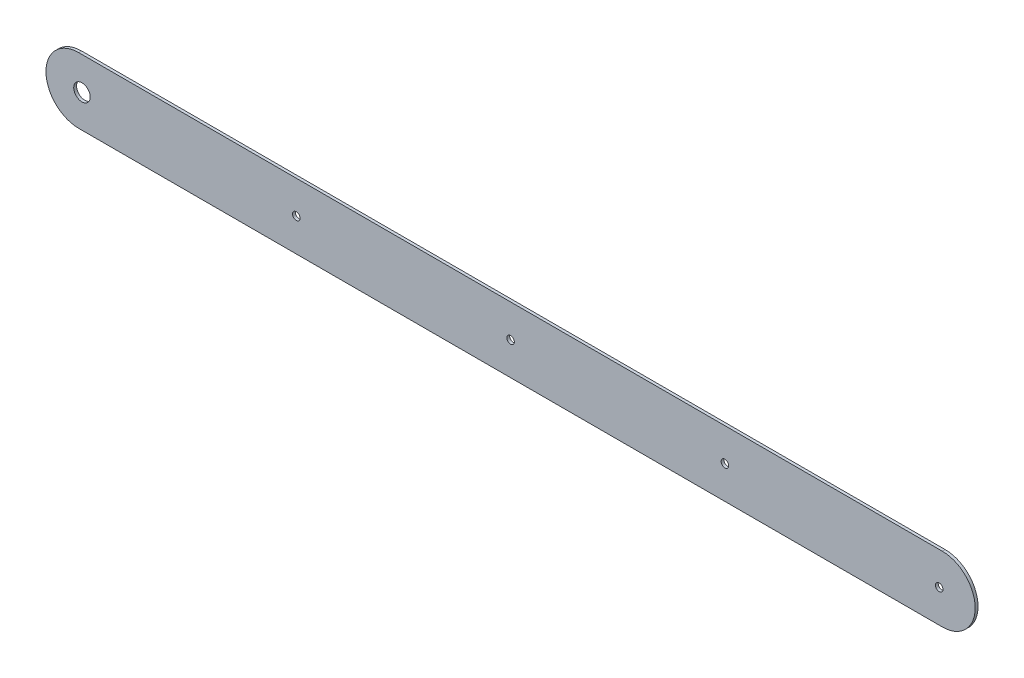
ISO-10303-21;
HEADER;
FILE_DESCRIPTION(('STEP AP214'),'2;1');
FILE_NAME('part.step','',(''),(''),'','','');
FILE_SCHEMA(('AUTOMOTIVE_DESIGN { 1 0 10303 214 1 1 1 1 }'));
ENDSEC;
DATA;
#1=APPLICATION_CONTEXT('core data for automotive mechanical design processes');
#2=APPLICATION_PROTOCOL_DEFINITION('international standard','automotive_design',2000,#1);
#3=PRODUCT_CONTEXT('',#1,'mechanical');
#4=PRODUCT('Part','Part','',(#3));
#5=PRODUCT_RELATED_PRODUCT_CATEGORY('part','',(#4));
#6=PRODUCT_DEFINITION_FORMATION('','',#4);
#7=PRODUCT_DEFINITION_CONTEXT('part definition',#1,'design');
#8=PRODUCT_DEFINITION('design','',#6,#7);
#9=PRODUCT_DEFINITION_SHAPE('','',#8);
#10=(LENGTH_UNIT() NAMED_UNIT(*) SI_UNIT(.MILLI.,.METRE.));
#11=(NAMED_UNIT(*) PLANE_ANGLE_UNIT() SI_UNIT($,.RADIAN.));
#12=(NAMED_UNIT(*) SI_UNIT($,.STERADIAN.) SOLID_ANGLE_UNIT());
#13=UNCERTAINTY_MEASURE_WITH_UNIT(LENGTH_MEASURE(1.E-05),#10,'distance_accuracy_value','');
#14=(GEOMETRIC_REPRESENTATION_CONTEXT(3) GLOBAL_UNCERTAINTY_ASSIGNED_CONTEXT((#13)) GLOBAL_UNIT_ASSIGNED_CONTEXT((#10,
#11,#12)) REPRESENTATION_CONTEXT('',''));
#15=CARTESIAN_POINT('',(0.,0.,0.));
#16=DIRECTION('',(0.,0.,1.));
#17=DIRECTION('',(1.,0.,0.));
#18=AXIS2_PLACEMENT_3D('',#15,#16,#17);
#19=CARTESIAN_POINT('',(914.400000000001,4.47926813256137E-13,3.));
#20=DIRECTION('',(0.,0.,1.));
#21=DIRECTION('',(1.,0.,0.));
#22=AXIS2_PLACEMENT_3D('',#19,#20,#21);
#23=PLANE('',#22);
#24=CARTESIAN_POINT('',(-453.85,0.,3.));
#25=DIRECTION('',(0.,0.,1.));
#26=DIRECTION('',(1.,0.,0.));
#27=AXIS2_PLACEMENT_3D('',#24,#25,#26);
#28=CIRCLE('',#27,7.99999999999998);
#29=CARTESIAN_POINT('',(-445.85,0.,3.));
#30=VERTEX_POINT('',#29);
#31=EDGE_CURVE('E140',#30,#30,#28,.T.);
#32=ORIENTED_EDGE('',*,*,#31,.F.);
#33=EDGE_LOOP('',(#32));
#34=FACE_BOUND('',#33,.T.);
#35=CARTESIAN_POINT('',(0.,0.,3.));
#36=DIRECTION('',(0.,0.,1.));
#37=DIRECTION('',(1.,0.,0.));
#38=AXIS2_PLACEMENT_3D('',#35,#36,#37);
#39=CIRCLE('',#38,8.);
#40=CARTESIAN_POINT('',(8.,0.,3.));
#41=VERTEX_POINT('',#40);
#42=EDGE_CURVE('E159',#41,#41,#39,.T.);
#43=ORIENTED_EDGE('',*,*,#42,.F.);
#44=EDGE_LOOP('',(#43));
#45=FACE_BOUND('',#44,.T.);
#46=CARTESIAN_POINT('',(907.7,0.,3.));
#47=DIRECTION('',(0.,0.,1.));
#48=DIRECTION('',(1.,0.,0.));
#49=AXIS2_PLACEMENT_3D('',#46,#47,#48);
#50=CIRCLE('',#49,7.99999999999998);
#51=CARTESIAN_POINT('',(915.7,0.,3.));
#52=VERTEX_POINT('',#51);
#53=EDGE_CURVE('E163',#52,#52,#50,.T.);
#54=ORIENTED_EDGE('',*,*,#53,.F.);
#55=EDGE_LOOP('',(#54));
#56=FACE_BOUND('',#55,.T.);
#57=CARTESIAN_POINT('',(-907.7,1.52215575888043E-13,3.));
#58=DIRECTION('',(0.,0.,1.));
#59=DIRECTION('',(1.,0.,0.));
#60=AXIS2_PLACEMENT_3D('',#57,#58,#59);
#61=CIRCLE('',#60,17.4999999999999);
#62=CARTESIAN_POINT('',(-890.2,1.52215575888043E-13,3.));
#63=VERTEX_POINT('',#62);
#64=EDGE_CURVE('E167',#63,#63,#61,.T.);
#65=ORIENTED_EDGE('',*,*,#64,.F.);
#66=EDGE_LOOP('',(#65));
#67=FACE_BOUND('',#66,.T.);
#68=CARTESIAN_POINT('',(453.85,0.,3.));
#69=DIRECTION('',(0.,0.,1.));
#70=DIRECTION('',(1.,0.,0.));
#71=AXIS2_PLACEMENT_3D('',#68,#69,#70);
#72=CIRCLE('',#71,7.99999999999998);
#73=CARTESIAN_POINT('',(461.85,0.,3.));
#74=VERTEX_POINT('',#73);
#75=EDGE_CURVE('E171',#74,#74,#72,.T.);
#76=ORIENTED_EDGE('',*,*,#75,.F.);
#77=EDGE_LOOP('',(#76));
#78=FACE_BOUND('',#77,.T.);
#79=DIRECTION('',(1.,0.,0.));
#80=VECTOR('',#79,1.);
#81=CARTESIAN_POINT('',(0.,-69.5000000000002,3.));
#82=LINE('',#81,#80);
#83=CARTESIAN_POINT('',(-914.400000000001,-69.4999999999999,3.));
#84=VERTEX_POINT('',#83);
#85=CARTESIAN_POINT('',(914.399999999999,-69.4999999999997,3.));
#86=VERTEX_POINT('',#85);
#87=EDGE_CURVE('E119',#84,#86,#82,.T.);
#88=ORIENTED_EDGE('',*,*,#87,.T.);
#89=CARTESIAN_POINT('',(914.400000000001,4.47926813256137E-13,3.));
#90=DIRECTION('',(0.,0.,1.));
#91=DIRECTION('',(1.,0.,0.));
#92=AXIS2_PLACEMENT_3D('',#89,#90,#91);
#93=CIRCLE('',#92,69.5000000000001);
#94=CARTESIAN_POINT('',(914.399999999999,69.4999999999997,3.));
#95=VERTEX_POINT('',#94);
#96=EDGE_CURVE('E112',#86,#95,#93,.T.);
#97=ORIENTED_EDGE('',*,*,#96,.T.);
#98=DIRECTION('',(1.,0.,0.));
#99=VECTOR('',#98,1.);
#100=CARTESIAN_POINT('',(0.,69.4999999999999,3.));
#101=LINE('',#100,#99);
#102=CARTESIAN_POINT('',(-914.400000000001,69.5,3.));
#103=VERTEX_POINT('',#102);
#104=EDGE_CURVE('E118',#103,#95,#101,.T.);
#105=ORIENTED_EDGE('',*,*,#104,.F.);
#106=CARTESIAN_POINT('',(-914.400000000001,0.,3.));
#107=DIRECTION('',(0.,0.,1.));
#108=DIRECTION('',(1.,0.,0.));
#109=AXIS2_PLACEMENT_3D('',#106,#107,#108);
#110=CIRCLE('',#109,69.5);
#111=EDGE_CURVE('E131',#84,#103,#110,.F.);
#112=ORIENTED_EDGE('',*,*,#111,.F.);
#113=EDGE_LOOP('',(#88,#97,#105,#112));
#114=FACE_BOUND('',#113,.T.);
#115=ADVANCED_FACE('F69',(#34,#45,#56,#67,#78,#114),#23,.T.);
#116=CARTESIAN_POINT('',(914.400000000001,4.47926813256137E-13,-3.));
#117=DIRECTION('',(0.,0.,1.));
#118=DIRECTION('',(1.,0.,0.));
#119=AXIS2_PLACEMENT_3D('',#116,#117,#118);
#120=PLANE('',#119);
#121=CARTESIAN_POINT('',(-453.85,0.,-3.));
#122=DIRECTION('',(0.,0.,1.));
#123=DIRECTION('',(1.,0.,0.));
#124=AXIS2_PLACEMENT_3D('',#121,#122,#123);
#125=CIRCLE('',#124,7.99999999999998);
#126=CARTESIAN_POINT('',(-445.85,0.,-3.));
#127=VERTEX_POINT('',#126);
#128=EDGE_CURVE('E179',#127,#127,#125,.T.);
#129=ORIENTED_EDGE('',*,*,#128,.T.);
#130=EDGE_LOOP('',(#129));
#131=FACE_BOUND('',#130,.T.);
#132=CARTESIAN_POINT('',(0.,0.,-3.));
#133=DIRECTION('',(0.,0.,1.));
#134=DIRECTION('',(1.,0.,0.));
#135=AXIS2_PLACEMENT_3D('',#132,#133,#134);
#136=CIRCLE('',#135,8.);
#137=CARTESIAN_POINT('',(8.,0.,-3.));
#138=VERTEX_POINT('',#137);
#139=EDGE_CURVE('E180',#138,#138,#136,.T.);
#140=ORIENTED_EDGE('',*,*,#139,.T.);
#141=EDGE_LOOP('',(#140));
#142=FACE_BOUND('',#141,.T.);
#143=CARTESIAN_POINT('',(907.7,0.,-3.));
#144=DIRECTION('',(0.,0.,1.));
#145=DIRECTION('',(1.,0.,0.));
#146=AXIS2_PLACEMENT_3D('',#143,#144,#145);
#147=CIRCLE('',#146,7.99999999999998);
#148=CARTESIAN_POINT('',(915.7,0.,-3.));
#149=VERTEX_POINT('',#148);
#150=EDGE_CURVE('E184',#149,#149,#147,.T.);
#151=ORIENTED_EDGE('',*,*,#150,.T.);
#152=EDGE_LOOP('',(#151));
#153=FACE_BOUND('',#152,.T.);
#154=CARTESIAN_POINT('',(-907.7,1.52215575888043E-13,-3.));
#155=DIRECTION('',(0.,0.,1.));
#156=DIRECTION('',(1.,0.,0.));
#157=AXIS2_PLACEMENT_3D('',#154,#155,#156);
#158=CIRCLE('',#157,17.4999999999999);
#159=CARTESIAN_POINT('',(-890.2,1.52215575888043E-13,-3.));
#160=VERTEX_POINT('',#159);
#161=EDGE_CURVE('E188',#160,#160,#158,.T.);
#162=ORIENTED_EDGE('',*,*,#161,.T.);
#163=EDGE_LOOP('',(#162));
#164=FACE_BOUND('',#163,.T.);
#165=CARTESIAN_POINT('',(453.85,0.,-3.));
#166=DIRECTION('',(0.,0.,1.));
#167=DIRECTION('',(1.,0.,0.));
#168=AXIS2_PLACEMENT_3D('',#165,#166,#167);
#169=CIRCLE('',#168,7.99999999999998);
#170=CARTESIAN_POINT('',(461.85,0.,-3.));
#171=VERTEX_POINT('',#170);
#172=EDGE_CURVE('E175',#171,#171,#169,.T.);
#173=ORIENTED_EDGE('',*,*,#172,.T.);
#174=EDGE_LOOP('',(#173));
#175=FACE_BOUND('',#174,.T.);
#176=DIRECTION('',(1.,0.,0.));
#177=VECTOR('',#176,1.);
#178=CARTESIAN_POINT('',(0.,-69.5000000000002,-3.));
#179=LINE('',#178,#177);
#180=CARTESIAN_POINT('',(-914.400000000001,-69.4999999999999,-3.));
#181=VERTEX_POINT('',#180);
#182=CARTESIAN_POINT('',(914.399999999999,-69.4999999999997,-3.));
#183=VERTEX_POINT('',#182);
#184=EDGE_CURVE('E137',#181,#183,#179,.T.);
#185=ORIENTED_EDGE('',*,*,#184,.F.);
#186=CARTESIAN_POINT('',(-914.400000000001,0.,-3.));
#187=DIRECTION('',(0.,0.,1.));
#188=DIRECTION('',(1.,0.,0.));
#189=AXIS2_PLACEMENT_3D('',#186,#187,#188);
#190=CIRCLE('',#189,69.5);
#191=CARTESIAN_POINT('',(-914.400000000001,69.5,-3.));
#192=VERTEX_POINT('',#191);
#193=EDGE_CURVE('E146',#181,#192,#190,.F.);
#194=ORIENTED_EDGE('',*,*,#193,.T.);
#195=DIRECTION('',(1.,0.,0.));
#196=VECTOR('',#195,1.);
#197=CARTESIAN_POINT('',(0.,69.4999999999999,-3.));
#198=LINE('',#197,#196);
#199=CARTESIAN_POINT('',(914.399999999999,69.4999999999997,-3.));
#200=VERTEX_POINT('',#199);
#201=EDGE_CURVE('E143',#192,#200,#198,.T.);
#202=ORIENTED_EDGE('',*,*,#201,.T.);
#203=CARTESIAN_POINT('',(914.400000000001,4.47926813256137E-13,-3.));
#204=DIRECTION('',(0.,0.,1.));
#205=DIRECTION('',(1.,0.,0.));
#206=AXIS2_PLACEMENT_3D('',#203,#204,#205);
#207=CIRCLE('',#206,69.5000000000001);
#208=EDGE_CURVE('E125',#183,#200,#207,.T.);
#209=ORIENTED_EDGE('',*,*,#208,.F.);
#210=EDGE_LOOP('',(#185,#194,#202,#209));
#211=FACE_BOUND('',#210,.T.);
#212=ADVANCED_FACE('F196',(#131,#142,#153,#164,#175,#211),#120,.F.);
#213=CARTESIAN_POINT('',(0.,-69.5000000000002,3.));
#214=DIRECTION('',(0.,1.,0.));
#215=DIRECTION('',(-1.,0.,0.));
#216=AXIS2_PLACEMENT_3D('',#213,#214,#215);
#217=PLANE('',#216);
#218=ORIENTED_EDGE('',*,*,#184,.T.);
#219=DIRECTION('',(0.,0.,-1.));
#220=VECTOR('',#219,1.);
#221=CARTESIAN_POINT('',(914.399999999999,-69.4999999999997,3.));
#222=LINE('',#221,#220);
#223=EDGE_CURVE('E12',#86,#183,#222,.T.);
#224=ORIENTED_EDGE('',*,*,#223,.F.);
#225=ORIENTED_EDGE('',*,*,#87,.F.);
#226=DIRECTION('',(0.,0.,-1.));
#227=VECTOR('',#226,1.);
#228=CARTESIAN_POINT('',(-914.400000000001,-69.4999999999999,3.));
#229=LINE('',#228,#227);
#230=EDGE_CURVE('E87',#84,#181,#229,.T.);
#231=ORIENTED_EDGE('',*,*,#230,.T.);
#232=EDGE_LOOP('',(#218,#224,#225,#231));
#233=FACE_BOUND('',#232,.T.);
#234=ADVANCED_FACE('F71',(#233),#217,.F.);
#235=CARTESIAN_POINT('',(914.400000000001,4.47926813256137E-13,3.));
#236=DIRECTION('',(0.,0.,-1.));
#237=DIRECTION('',(-1.,0.,0.));
#238=AXIS2_PLACEMENT_3D('',#235,#236,#237);
#239=CYLINDRICAL_SURFACE('',#238,69.5000000000001);
#240=ORIENTED_EDGE('',*,*,#208,.T.);
#241=DIRECTION('',(0.,0.,-1.));
#242=VECTOR('',#241,1.);
#243=CARTESIAN_POINT('',(914.399999999999,69.4999999999997,3.));
#244=LINE('',#243,#242);
#245=EDGE_CURVE('E79',#95,#200,#244,.T.);
#246=ORIENTED_EDGE('',*,*,#245,.F.);
#247=ORIENTED_EDGE('',*,*,#96,.F.);
#248=ORIENTED_EDGE('',*,*,#223,.T.);
#249=EDGE_LOOP('',(#240,#246,#247,#248));
#250=FACE_BOUND('',#249,.T.);
#251=ADVANCED_FACE('F124',(#250),#239,.T.);
#252=CARTESIAN_POINT('',(0.,69.4999999999999,3.));
#253=DIRECTION('',(0.,1.,0.));
#254=DIRECTION('',(-1.,0.,0.));
#255=AXIS2_PLACEMENT_3D('',#252,#253,#254);
#256=PLANE('',#255);
#257=ORIENTED_EDGE('',*,*,#201,.F.);
#258=DIRECTION('',(0.,0.,-1.));
#259=VECTOR('',#258,1.);
#260=CARTESIAN_POINT('',(-914.400000000001,69.5,3.));
#261=LINE('',#260,#259);
#262=EDGE_CURVE('E101',#103,#192,#261,.T.);
#263=ORIENTED_EDGE('',*,*,#262,.F.);
#264=ORIENTED_EDGE('',*,*,#104,.T.);
#265=ORIENTED_EDGE('',*,*,#245,.T.);
#266=EDGE_LOOP('',(#257,#263,#264,#265));
#267=FACE_BOUND('',#266,.T.);
#268=ADVANCED_FACE('F129',(#267),#256,.T.);
#269=CARTESIAN_POINT('',(-914.400000000001,0.,3.));
#270=DIRECTION('',(0.,0.,-1.));
#271=DIRECTION('',(-1.,0.,0.));
#272=AXIS2_PLACEMENT_3D('',#269,#270,#271);
#273=CYLINDRICAL_SURFACE('',#272,69.5);
#274=ORIENTED_EDGE('',*,*,#193,.F.);
#275=ORIENTED_EDGE('',*,*,#230,.F.);
#276=ORIENTED_EDGE('',*,*,#111,.T.);
#277=ORIENTED_EDGE('',*,*,#262,.T.);
#278=EDGE_LOOP('',(#274,#275,#276,#277));
#279=FACE_BOUND('',#278,.T.);
#280=ADVANCED_FACE('F228',(#279),#273,.T.);
#281=CARTESIAN_POINT('',(453.85,0.,-3.));
#282=DIRECTION('',(0.,0.,1.));
#283=DIRECTION('',(1.,0.,0.));
#284=AXIS2_PLACEMENT_3D('',#281,#282,#283);
#285=CYLINDRICAL_SURFACE('',#284,7.99999999999998);
#286=ORIENTED_EDGE('',*,*,#75,.T.);
#287=EDGE_LOOP('',(#286));
#288=FACE_BOUND('',#287,.T.);
#289=ORIENTED_EDGE('',*,*,#172,.F.);
#290=EDGE_LOOP('',(#289));
#291=FACE_BOUND('',#290,.T.);
#292=ADVANCED_FACE('F212',(#288,#291),#285,.F.);
#293=CARTESIAN_POINT('',(-907.7,1.52215575888043E-13,-3.));
#294=DIRECTION('',(0.,0.,1.));
#295=DIRECTION('',(1.,0.,0.));
#296=AXIS2_PLACEMENT_3D('',#293,#294,#295);
#297=CYLINDRICAL_SURFACE('',#296,17.4999999999999);
#298=ORIENTED_EDGE('',*,*,#64,.T.);
#299=EDGE_LOOP('',(#298));
#300=FACE_BOUND('',#299,.T.);
#301=ORIENTED_EDGE('',*,*,#161,.F.);
#302=EDGE_LOOP('',(#301));
#303=FACE_BOUND('',#302,.T.);
#304=ADVANCED_FACE('F202',(#300,#303),#297,.F.);
#305=CARTESIAN_POINT('',(907.7,0.,-3.));
#306=DIRECTION('',(0.,0.,1.));
#307=DIRECTION('',(1.,0.,0.));
#308=AXIS2_PLACEMENT_3D('',#305,#306,#307);
#309=CYLINDRICAL_SURFACE('',#308,7.99999999999998);
#310=ORIENTED_EDGE('',*,*,#53,.T.);
#311=EDGE_LOOP('',(#310));
#312=FACE_BOUND('',#311,.T.);
#313=ORIENTED_EDGE('',*,*,#150,.F.);
#314=EDGE_LOOP('',(#313));
#315=FACE_BOUND('',#314,.T.);
#316=ADVANCED_FACE('F199',(#312,#315),#309,.F.);
#317=CARTESIAN_POINT('',(0.,0.,-3.));
#318=DIRECTION('',(0.,0.,1.));
#319=DIRECTION('',(1.,0.,0.));
#320=AXIS2_PLACEMENT_3D('',#317,#318,#319);
#321=CYLINDRICAL_SURFACE('',#320,8.);
#322=ORIENTED_EDGE('',*,*,#42,.T.);
#323=EDGE_LOOP('',(#322));
#324=FACE_BOUND('',#323,.T.);
#325=ORIENTED_EDGE('',*,*,#139,.F.);
#326=EDGE_LOOP('',(#325));
#327=FACE_BOUND('',#326,.T.);
#328=ADVANCED_FACE('F201',(#324,#327),#321,.F.);
#329=CARTESIAN_POINT('',(-453.85,0.,-3.));
#330=DIRECTION('',(0.,0.,1.));
#331=DIRECTION('',(1.,0.,0.));
#332=AXIS2_PLACEMENT_3D('',#329,#330,#331);
#333=CYLINDRICAL_SURFACE('',#332,7.99999999999998);
#334=ORIENTED_EDGE('',*,*,#31,.T.);
#335=EDGE_LOOP('',(#334));
#336=FACE_BOUND('',#335,.T.);
#337=ORIENTED_EDGE('',*,*,#128,.F.);
#338=EDGE_LOOP('',(#337));
#339=FACE_BOUND('',#338,.T.);
#340=ADVANCED_FACE('F209',(#336,#339),#333,.F.);
#341=CLOSED_SHELL('',(#115,#212,#234,#251,#268,#280,#292,#304,#316,#328,#340));
#342=MANIFOLD_SOLID_BREP('B2',#341);
#343=ADVANCED_BREP_SHAPE_REPRESENTATION('',(#18,#342),#14);
#344=SHAPE_DEFINITION_REPRESENTATION(#9,#343);
ENDSEC;
END-ISO-10303-21;
